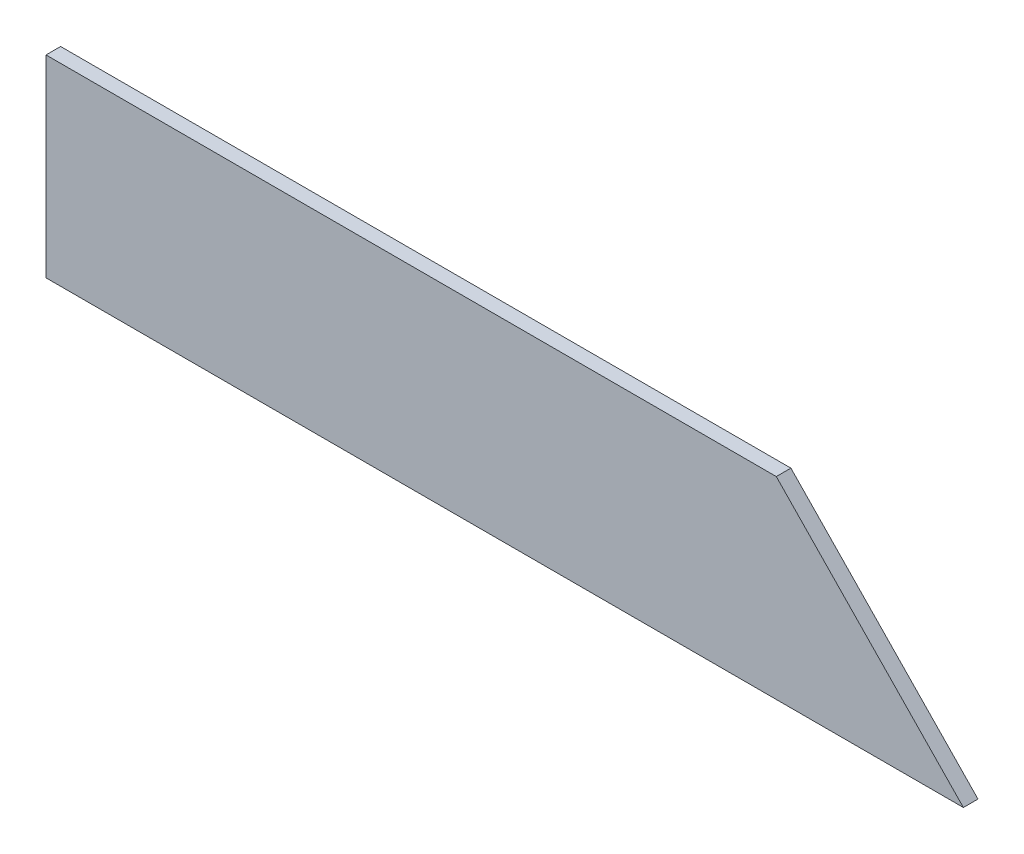
ISO-10303-21;
HEADER;
FILE_DESCRIPTION(('STEP AP214'),'2;1');
FILE_NAME('part.step','',(''),(''),'','','');
FILE_SCHEMA(('AUTOMOTIVE_DESIGN { 1 0 10303 214 1 1 1 1 }'));
ENDSEC;
DATA;
#1=APPLICATION_CONTEXT('core data for automotive mechanical design processes');
#2=APPLICATION_PROTOCOL_DEFINITION('international standard','automotive_design',2000,#1);
#3=PRODUCT_CONTEXT('',#1,'mechanical');
#4=PRODUCT('Part','Part','',(#3));
#5=PRODUCT_RELATED_PRODUCT_CATEGORY('part','',(#4));
#6=PRODUCT_DEFINITION_FORMATION('','',#4);
#7=PRODUCT_DEFINITION_CONTEXT('part definition',#1,'design');
#8=PRODUCT_DEFINITION('design','',#6,#7);
#9=PRODUCT_DEFINITION_SHAPE('','',#8);
#10=(LENGTH_UNIT() NAMED_UNIT(*) SI_UNIT(.MILLI.,.METRE.));
#11=(NAMED_UNIT(*) PLANE_ANGLE_UNIT() SI_UNIT($,.RADIAN.));
#12=(NAMED_UNIT(*) SI_UNIT($,.STERADIAN.) SOLID_ANGLE_UNIT());
#13=UNCERTAINTY_MEASURE_WITH_UNIT(LENGTH_MEASURE(1.E-05),#10,'distance_accuracy_value','');
#14=(GEOMETRIC_REPRESENTATION_CONTEXT(3) GLOBAL_UNCERTAINTY_ASSIGNED_CONTEXT((#13)) GLOBAL_UNIT_ASSIGNED_CONTEXT((#10,
#11,#12)) REPRESENTATION_CONTEXT('',''));
#15=CARTESIAN_POINT('',(0.,0.,0.));
#16=DIRECTION('',(0.,0.,1.));
#17=DIRECTION('',(1.,0.,0.));
#18=AXIS2_PLACEMENT_3D('',#15,#16,#17);
#19=CARTESIAN_POINT('',(-521.165051983208,229.064634146341,18.25625));
#20=DIRECTION('',(1.,0.,0.));
#21=DIRECTION('',(0.,0.,-1.));
#22=AXIS2_PLACEMENT_3D('',#19,#20,#21);
#23=PLANE('',#22);
#24=DIRECTION('',(0.,-1.,0.));
#25=VECTOR('',#24,1.);
#26=CARTESIAN_POINT('',(-521.165051983208,229.064634146341,0.));
#27=LINE('',#26,#25);
#28=CARTESIAN_POINT('',(-521.165051983208,229.064634146341,0.));
#29=VERTEX_POINT('',#28);
#30=CARTESIAN_POINT('',(-521.165051983208,-12.2353658536585,0.));
#31=VERTEX_POINT('',#30);
#32=EDGE_CURVE('E95',#29,#31,#27,.T.);
#33=ORIENTED_EDGE('',*,*,#32,.T.);
#34=DIRECTION('',(0.,0.,-1.));
#35=VECTOR('',#34,1.);
#36=CARTESIAN_POINT('',(-521.165051983208,-12.2353658536585,18.25625));
#37=LINE('',#36,#35);
#38=CARTESIAN_POINT('',(-521.165051983208,-12.2353658536585,18.25625));
#39=VERTEX_POINT('',#38);
#40=EDGE_CURVE('E11',#39,#31,#37,.T.);
#41=ORIENTED_EDGE('',*,*,#40,.F.);
#42=DIRECTION('',(0.,-1.,0.));
#43=VECTOR('',#42,1.);
#44=CARTESIAN_POINT('',(-521.165051983208,229.064634146341,18.25625));
#45=LINE('',#44,#43);
#46=CARTESIAN_POINT('',(-521.165051983208,229.064634146341,18.25625));
#47=VERTEX_POINT('',#46);
#48=EDGE_CURVE('E83',#47,#39,#45,.T.);
#49=ORIENTED_EDGE('',*,*,#48,.F.);
#50=DIRECTION('',(0.,0.,-1.));
#51=VECTOR('',#50,1.);
#52=CARTESIAN_POINT('',(-521.165051983208,229.064634146341,18.25625));
#53=LINE('',#52,#51);
#54=EDGE_CURVE('E91',#47,#29,#53,.T.);
#55=ORIENTED_EDGE('',*,*,#54,.T.);
#56=EDGE_LOOP('',(#33,#41,#49,#55));
#57=FACE_BOUND('',#56,.T.);
#58=ADVANCED_FACE('F32',(#57),#23,.F.);
#59=CARTESIAN_POINT('',(-521.165051983208,-12.2353658536585,18.25625));
#60=DIRECTION('',(0.,1.,0.));
#61=DIRECTION('',(0.,0.,1.));
#62=AXIS2_PLACEMENT_3D('',#59,#60,#61);
#63=PLANE('',#62);
#64=DIRECTION('',(1.,0.,0.));
#65=VECTOR('',#64,1.);
#66=CARTESIAN_POINT('',(-521.165051983208,-12.2353658536585,0.));
#67=LINE('',#66,#65);
#68=CARTESIAN_POINT('',(625.390948016792,-12.2353658536585,0.));
#69=VERTEX_POINT('',#68);
#70=EDGE_CURVE('E87',#31,#69,#67,.T.);
#71=ORIENTED_EDGE('',*,*,#70,.T.);
#72=DIRECTION('',(0.,0.,-1.));
#73=VECTOR('',#72,1.);
#74=CARTESIAN_POINT('',(625.390948016792,-12.2353658536585,18.25625));
#75=LINE('',#74,#73);
#76=CARTESIAN_POINT('',(625.390948016792,-12.2353658536585,18.25625));
#77=VERTEX_POINT('',#76);
#78=EDGE_CURVE('E40',#77,#69,#75,.T.);
#79=ORIENTED_EDGE('',*,*,#78,.F.);
#80=DIRECTION('',(1.,0.,0.));
#81=VECTOR('',#80,1.);
#82=CARTESIAN_POINT('',(-521.165051983208,-12.2353658536585,18.25625));
#83=LINE('',#82,#81);
#84=EDGE_CURVE('E78',#39,#77,#83,.T.);
#85=ORIENTED_EDGE('',*,*,#84,.F.);
#86=ORIENTED_EDGE('',*,*,#40,.T.);
#87=EDGE_LOOP('',(#71,#79,#85,#86));
#88=FACE_BOUND('',#87,.T.);
#89=ADVANCED_FACE('F86',(#88),#63,.F.);
#90=CARTESIAN_POINT('',(625.390948016792,-12.2353658536585,18.25625));
#91=DIRECTION('',(-0.718126297763185,-0.695912796592318,0.));
#92=DIRECTION('',(0.695912796592318,-0.718126297763185,0.));
#93=AXIS2_PLACEMENT_3D('',#90,#91,#92);
#94=PLANE('',#93);
#95=DIRECTION('',(-0.695912796592318,0.718126297763185,0.));
#96=VECTOR('',#95,1.);
#97=CARTESIAN_POINT('',(625.390948016792,-12.2353658536585,0.));
#98=LINE('',#97,#96);
#99=CARTESIAN_POINT('',(391.554980247927,229.064634146341,0.));
#100=VERTEX_POINT('',#99);
#101=EDGE_CURVE('E65',#69,#100,#98,.T.);
#102=ORIENTED_EDGE('',*,*,#101,.T.);
#103=DIRECTION('',(0.,0.,-1.));
#104=VECTOR('',#103,1.);
#105=CARTESIAN_POINT('',(391.554980247927,229.064634146341,18.25625));
#106=LINE('',#105,#104);
#107=CARTESIAN_POINT('',(391.554980247927,229.064634146341,18.25625));
#108=VERTEX_POINT('',#107);
#109=EDGE_CURVE('E88',#108,#100,#106,.T.);
#110=ORIENTED_EDGE('',*,*,#109,.F.);
#111=DIRECTION('',(-0.695912796592318,0.718126297763185,0.));
#112=VECTOR('',#111,1.);
#113=CARTESIAN_POINT('',(625.390948016792,-12.2353658536585,18.25625));
#114=LINE('',#113,#112);
#115=EDGE_CURVE('E81',#77,#108,#114,.T.);
#116=ORIENTED_EDGE('',*,*,#115,.F.);
#117=ORIENTED_EDGE('',*,*,#78,.T.);
#118=EDGE_LOOP('',(#102,#110,#116,#117));
#119=FACE_BOUND('',#118,.T.);
#120=ADVANCED_FACE('F89',(#119),#94,.F.);
#121=CARTESIAN_POINT('',(-521.165051983208,229.064634146341,18.25625));
#122=DIRECTION('',(0.,-1.,0.));
#123=DIRECTION('',(0.,0.,-1.));
#124=AXIS2_PLACEMENT_3D('',#121,#122,#123);
#125=PLANE('',#124);
#126=DIRECTION('',(-1.,0.,0.));
#127=VECTOR('',#126,1.);
#128=CARTESIAN_POINT('',(-521.165051983208,229.064634146341,0.));
#129=LINE('',#128,#127);
#130=EDGE_CURVE('E71',#100,#29,#129,.T.);
#131=ORIENTED_EDGE('',*,*,#130,.T.);
#132=ORIENTED_EDGE('',*,*,#54,.F.);
#133=DIRECTION('',(-1.,0.,0.));
#134=VECTOR('',#133,1.);
#135=CARTESIAN_POINT('',(-521.165051983208,229.064634146341,18.25625));
#136=LINE('',#135,#134);
#137=EDGE_CURVE('E48',#108,#47,#136,.T.);
#138=ORIENTED_EDGE('',*,*,#137,.F.);
#139=ORIENTED_EDGE('',*,*,#109,.T.);
#140=EDGE_LOOP('',(#131,#132,#138,#139));
#141=FACE_BOUND('',#140,.T.);
#142=ADVANCED_FACE('F102',(#141),#125,.F.);
#143=CARTESIAN_POINT('',(0.,0.,18.25625));
#144=DIRECTION('',(0.,0.,1.));
#145=DIRECTION('',(1.,0.,0.));
#146=AXIS2_PLACEMENT_3D('',#143,#144,#145);
#147=PLANE('',#146);
#148=ORIENTED_EDGE('',*,*,#48,.T.);
#149=ORIENTED_EDGE('',*,*,#84,.T.);
#150=ORIENTED_EDGE('',*,*,#115,.T.);
#151=ORIENTED_EDGE('',*,*,#137,.T.);
#152=EDGE_LOOP('',(#148,#149,#150,#151));
#153=FACE_BOUND('',#152,.T.);
#154=ADVANCED_FACE('F79',(#153),#147,.T.);
#155=CARTESIAN_POINT('',(0.,0.,0.));
#156=DIRECTION('',(0.,0.,1.));
#157=DIRECTION('',(1.,0.,0.));
#158=AXIS2_PLACEMENT_3D('',#155,#156,#157);
#159=PLANE('',#158);
#160=ORIENTED_EDGE('',*,*,#32,.F.);
#161=ORIENTED_EDGE('',*,*,#130,.F.);
#162=ORIENTED_EDGE('',*,*,#101,.F.);
#163=ORIENTED_EDGE('',*,*,#70,.F.);
#164=EDGE_LOOP('',(#160,#161,#162,#163));
#165=FACE_BOUND('',#164,.T.);
#166=ADVANCED_FACE('F105',(#165),#159,.F.);
#167=CLOSED_SHELL('',(#58,#89,#120,#142,#154,#166));
#168=MANIFOLD_SOLID_BREP('B2',#167);
#169=ADVANCED_BREP_SHAPE_REPRESENTATION('',(#18,#168),#14);
#170=SHAPE_DEFINITION_REPRESENTATION(#9,#169);
ENDSEC;
END-ISO-10303-21;
